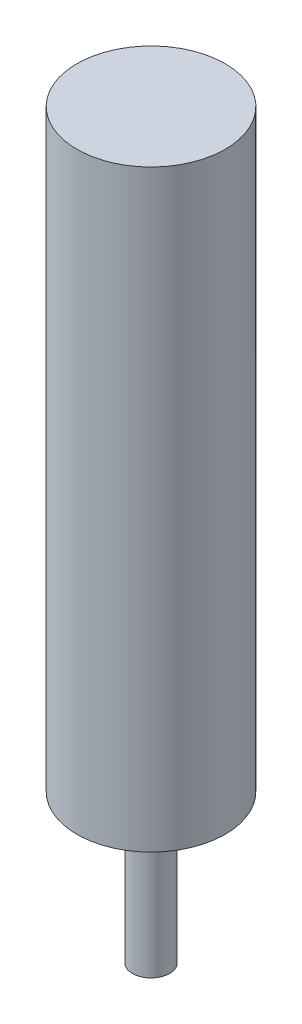
ISO-10303-21;
HEADER;
FILE_DESCRIPTION(('STEP AP214'),'2;1');
FILE_NAME('part.step','',(''),(''),'','','');
FILE_SCHEMA(('AUTOMOTIVE_DESIGN { 1 0 10303 214 1 1 1 1 }'));
ENDSEC;
DATA;
#1=APPLICATION_CONTEXT('core data for automotive mechanical design processes');
#2=APPLICATION_PROTOCOL_DEFINITION('international standard','automotive_design',2000,#1);
#3=PRODUCT_CONTEXT('',#1,'mechanical');
#4=PRODUCT('Part','Part','',(#3));
#5=PRODUCT_RELATED_PRODUCT_CATEGORY('part','',(#4));
#6=PRODUCT_DEFINITION_FORMATION('','',#4);
#7=PRODUCT_DEFINITION_CONTEXT('part definition',#1,'design');
#8=PRODUCT_DEFINITION('design','',#6,#7);
#9=PRODUCT_DEFINITION_SHAPE('','',#8);
#10=(LENGTH_UNIT() NAMED_UNIT(*) SI_UNIT(.MILLI.,.METRE.));
#11=(NAMED_UNIT(*) PLANE_ANGLE_UNIT() SI_UNIT($,.RADIAN.));
#12=(NAMED_UNIT(*) SI_UNIT($,.STERADIAN.) SOLID_ANGLE_UNIT());
#13=UNCERTAINTY_MEASURE_WITH_UNIT(LENGTH_MEASURE(1.E-05),#10,'distance_accuracy_value','');
#14=(GEOMETRIC_REPRESENTATION_CONTEXT(3) GLOBAL_UNCERTAINTY_ASSIGNED_CONTEXT((#13)) GLOBAL_UNIT_ASSIGNED_CONTEXT((#10,
#11,#12)) REPRESENTATION_CONTEXT('',''));
#15=CARTESIAN_POINT('',(0.,0.,0.));
#16=DIRECTION('',(0.,0.,1.));
#17=DIRECTION('',(1.,0.,0.));
#18=AXIS2_PLACEMENT_3D('',#15,#16,#17);
#19=CARTESIAN_POINT('',(0.,63.5,0.));
#20=DIRECTION('',(0.,1.,0.));
#21=DIRECTION('',(0.,0.,1.));
#22=AXIS2_PLACEMENT_3D('',#19,#20,#21);
#23=PLANE('',#22);
#24=CARTESIAN_POINT('',(0.,63.5,0.));
#25=DIRECTION('',(0.,-1.,0.));
#26=DIRECTION('',(0.,0.,-1.));
#27=AXIS2_PLACEMENT_3D('',#24,#25,#26);
#28=CIRCLE('',#27,6.35);
#29=CARTESIAN_POINT('',(0.,63.5,-6.35));
#30=VERTEX_POINT('',#29);
#31=EDGE_CURVE('E10',#30,#30,#28,.T.);
#32=ORIENTED_EDGE('',*,*,#31,.F.);
#33=EDGE_LOOP('',(#32));
#34=FACE_BOUND('',#33,.T.);
#35=ADVANCED_FACE('F37',(#34),#23,.T.);
#36=CARTESIAN_POINT('',(0.,0.,0.));
#37=DIRECTION('',(0.,-1.,0.));
#38=DIRECTION('',(0.,0.,-1.));
#39=AXIS2_PLACEMENT_3D('',#36,#37,#38);
#40=CYLINDRICAL_SURFACE('',#39,6.35);
#41=ORIENTED_EDGE('',*,*,#31,.T.);
#42=EDGE_LOOP('',(#41));
#43=FACE_BOUND('',#42,.T.);
#44=CARTESIAN_POINT('',(0.,12.7,0.));
#45=DIRECTION('',(0.,-1.,0.));
#46=DIRECTION('',(0.,0.,-1.));
#47=AXIS2_PLACEMENT_3D('',#44,#45,#46);
#48=CIRCLE('',#47,6.35000000000001);
#49=CARTESIAN_POINT('',(0.,12.7,-6.35000000000001));
#50=VERTEX_POINT('',#49);
#51=EDGE_CURVE('E44',#50,#50,#48,.T.);
#52=ORIENTED_EDGE('',*,*,#51,.F.);
#53=EDGE_LOOP('',(#52));
#54=FACE_BOUND('',#53,.T.);
#55=ADVANCED_FACE('F73',(#43,#54),#40,.T.);
#56=CARTESIAN_POINT('',(6.35000000000001,12.7,0.));
#57=DIRECTION('',(0.,-1.,0.));
#58=DIRECTION('',(0.,0.,-1.));
#59=AXIS2_PLACEMENT_3D('',#56,#57,#58);
#60=PLANE('',#59);
#61=ORIENTED_EDGE('',*,*,#51,.T.);
#62=EDGE_LOOP('',(#61));
#63=FACE_BOUND('',#62,.T.);
#64=CARTESIAN_POINT('',(0.,12.7,0.));
#65=DIRECTION('',(0.,-1.,0.));
#66=DIRECTION('',(0.,0.,-1.));
#67=AXIS2_PLACEMENT_3D('',#64,#65,#66);
#68=CIRCLE('',#67,1.5875);
#69=CARTESIAN_POINT('',(0.,12.7,-1.5875));
#70=VERTEX_POINT('',#69);
#71=EDGE_CURVE('E49',#70,#70,#68,.T.);
#72=ORIENTED_EDGE('',*,*,#71,.F.);
#73=EDGE_LOOP('',(#72));
#74=FACE_BOUND('',#73,.T.);
#75=ADVANCED_FACE('F65',(#63,#74),#60,.T.);
#76=CARTESIAN_POINT('',(0.,0.,0.));
#77=DIRECTION('',(0.,-1.,0.));
#78=DIRECTION('',(0.,0.,-1.));
#79=AXIS2_PLACEMENT_3D('',#76,#77,#78);
#80=CYLINDRICAL_SURFACE('',#79,1.5875);
#81=ORIENTED_EDGE('',*,*,#71,.T.);
#82=EDGE_LOOP('',(#81));
#83=FACE_BOUND('',#82,.T.);
#84=CARTESIAN_POINT('',(0.,0.,0.));
#85=DIRECTION('',(0.,-1.,0.));
#86=DIRECTION('',(0.,0.,-1.));
#87=AXIS2_PLACEMENT_3D('',#84,#85,#86);
#88=CIRCLE('',#87,1.5875);
#89=CARTESIAN_POINT('',(0.,0.,-1.5875));
#90=VERTEX_POINT('',#89);
#91=EDGE_CURVE('E54',#90,#90,#88,.T.);
#92=ORIENTED_EDGE('',*,*,#91,.F.);
#93=EDGE_LOOP('',(#92));
#94=FACE_BOUND('',#93,.T.);
#95=ADVANCED_FACE('F63',(#83,#94),#80,.T.);
#96=CARTESIAN_POINT('',(1.5875,0.,0.));
#97=DIRECTION('',(0.,-1.,0.));
#98=DIRECTION('',(0.,0.,-1.));
#99=AXIS2_PLACEMENT_3D('',#96,#97,#98);
#100=PLANE('',#99);
#101=ORIENTED_EDGE('',*,*,#91,.T.);
#102=EDGE_LOOP('',(#101));
#103=FACE_BOUND('',#102,.T.);
#104=ADVANCED_FACE('F61',(#103),#100,.T.);
#105=CLOSED_SHELL('',(#35,#55,#75,#95,#104));
#106=MANIFOLD_SOLID_BREP('B2',#105);
#107=ADVANCED_BREP_SHAPE_REPRESENTATION('',(#18,#106),#14);
#108=SHAPE_DEFINITION_REPRESENTATION(#9,#107);
ENDSEC;
END-ISO-10303-21;
